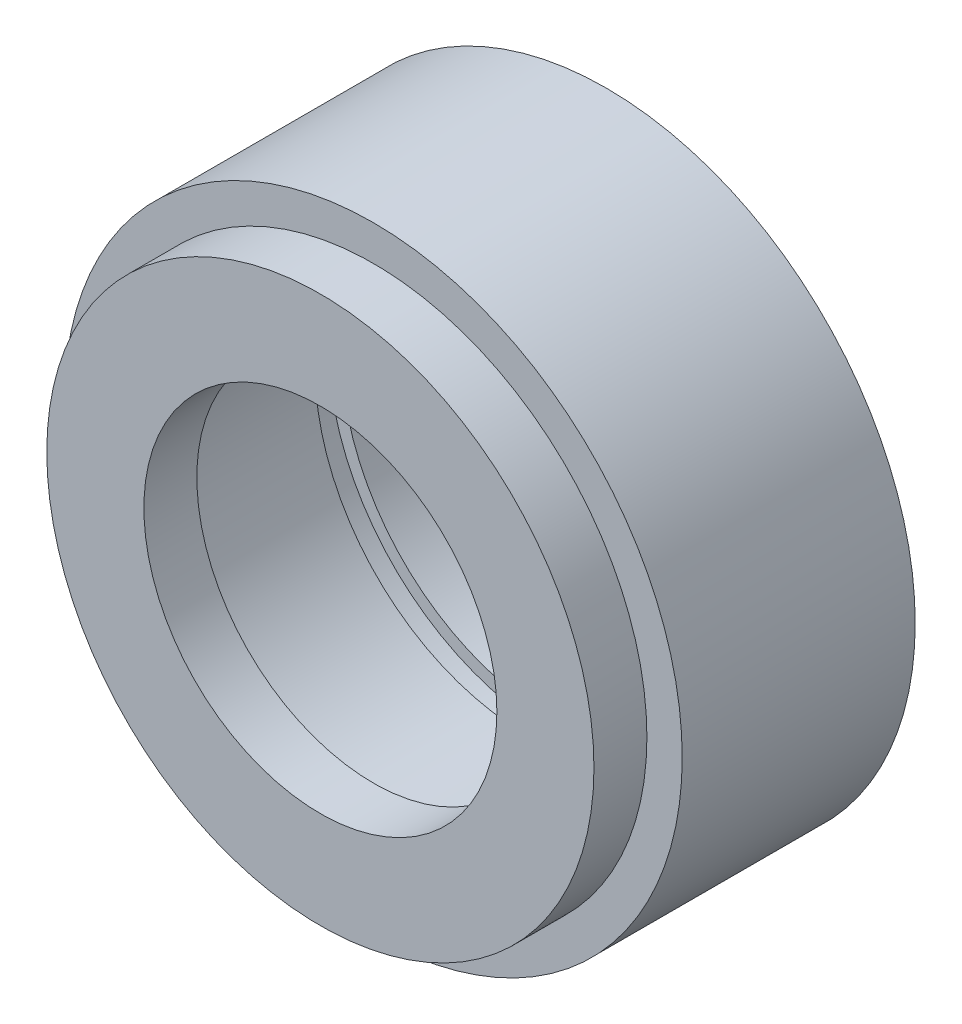
ISO-10303-21;
HEADER;
FILE_DESCRIPTION(('STEP AP214'),'2;1');
FILE_NAME('part.step','',(''),(''),'','','');
FILE_SCHEMA(('AUTOMOTIVE_DESIGN { 1 0 10303 214 1 1 1 1 }'));
ENDSEC;
DATA;
#1=APPLICATION_CONTEXT('core data for automotive mechanical design processes');
#2=APPLICATION_PROTOCOL_DEFINITION('international standard','automotive_design',2000,#1);
#3=PRODUCT_CONTEXT('',#1,'mechanical');
#4=PRODUCT('Part','Part','',(#3));
#5=PRODUCT_RELATED_PRODUCT_CATEGORY('part','',(#4));
#6=PRODUCT_DEFINITION_FORMATION('','',#4);
#7=PRODUCT_DEFINITION_CONTEXT('part definition',#1,'design');
#8=PRODUCT_DEFINITION('design','',#6,#7);
#9=PRODUCT_DEFINITION_SHAPE('','',#8);
#10=(LENGTH_UNIT() NAMED_UNIT(*) SI_UNIT(.MILLI.,.METRE.));
#11=(NAMED_UNIT(*) PLANE_ANGLE_UNIT() SI_UNIT($,.RADIAN.));
#12=(NAMED_UNIT(*) SI_UNIT($,.STERADIAN.) SOLID_ANGLE_UNIT());
#13=UNCERTAINTY_MEASURE_WITH_UNIT(LENGTH_MEASURE(1.E-05),#10,'distance_accuracy_value','');
#14=(GEOMETRIC_REPRESENTATION_CONTEXT(3) GLOBAL_UNCERTAINTY_ASSIGNED_CONTEXT((#13)) GLOBAL_UNIT_ASSIGNED_CONTEXT((#10,
#11,#12)) REPRESENTATION_CONTEXT('',''));
#15=CARTESIAN_POINT('',(0.,0.,0.));
#16=DIRECTION('',(0.,0.,1.));
#17=DIRECTION('',(1.,0.,0.));
#18=AXIS2_PLACEMENT_3D('',#15,#16,#17);
#19=CARTESIAN_POINT('',(0.,0.,999.999999999999));
#20=DIRECTION('',(0.,0.,1.));
#21=DIRECTION('',(1.,0.,0.));
#22=AXIS2_PLACEMENT_3D('',#19,#20,#21);
#23=CYLINDRICAL_SURFACE('',#22,12.);
#24=CARTESIAN_POINT('',(0.,0.,0.299999999999967));
#25=DIRECTION('',(0.,0.,1.));
#26=DIRECTION('',(1.,0.,0.));
#27=AXIS2_PLACEMENT_3D('',#24,#25,#26);
#28=CIRCLE('',#27,12.);
#29=CARTESIAN_POINT('',(12.,0.,0.299999999999968));
#30=VERTEX_POINT('',#29);
#31=EDGE_CURVE('E10',#30,#30,#28,.T.);
#32=ORIENTED_EDGE('',*,*,#31,.F.);
#33=EDGE_LOOP('',(#32));
#34=FACE_BOUND('',#33,.T.);
#35=CARTESIAN_POINT('',(1.11022302462516E-13,-1.11022302462516E-13,9.00000000000001));
#36=DIRECTION('',(0.,0.,1.));
#37=DIRECTION('',(1.,0.,0.));
#38=AXIS2_PLACEMENT_3D('',#35,#36,#37);
#39=CIRCLE('',#38,12.);
#40=CARTESIAN_POINT('',(12.0000000000001,-1.11245271162047E-13,9.00000000000001));
#41=VERTEX_POINT('',#40);
#42=EDGE_CURVE('E70',#41,#41,#39,.T.);
#43=ORIENTED_EDGE('',*,*,#42,.T.);
#44=EDGE_LOOP('',(#43));
#45=FACE_BOUND('',#44,.T.);
#46=ADVANCED_FACE('F30',(#34,#45),#23,.F.);
#47=CARTESIAN_POINT('',(0.,12.75,0.299999999999995));
#48=DIRECTION('',(0.,0.,1.));
#49=DIRECTION('',(1.,0.,0.));
#50=AXIS2_PLACEMENT_3D('',#47,#48,#49);
#51=PLANE('',#50);
#52=CARTESIAN_POINT('',(0.,0.,0.299999999999967));
#53=DIRECTION('',(0.,0.,1.));
#54=DIRECTION('',(1.,0.,0.));
#55=AXIS2_PLACEMENT_3D('',#52,#53,#54);
#56=CIRCLE('',#55,12.75);
#57=CARTESIAN_POINT('',(12.75,0.,0.299999999999968));
#58=VERTEX_POINT('',#57);
#59=EDGE_CURVE('E36',#58,#58,#56,.T.);
#60=ORIENTED_EDGE('',*,*,#59,.F.);
#61=EDGE_LOOP('',(#60));
#62=FACE_BOUND('',#61,.T.);
#63=ORIENTED_EDGE('',*,*,#31,.T.);
#64=EDGE_LOOP('',(#63));
#65=FACE_BOUND('',#64,.T.);
#66=ADVANCED_FACE('F131',(#62,#65),#51,.F.);
#67=CARTESIAN_POINT('',(0.,0.,999.999999999999));
#68=DIRECTION('',(0.,0.,1.));
#69=DIRECTION('',(1.,0.,0.));
#70=AXIS2_PLACEMENT_3D('',#67,#68,#69);
#71=CYLINDRICAL_SURFACE('',#70,12.75);
#72=CARTESIAN_POINT('',(1.11022302462516E-13,0.,-1.20000000000009));
#73=DIRECTION('',(0.,0.,1.));
#74=DIRECTION('',(1.,0.,0.));
#75=AXIS2_PLACEMENT_3D('',#72,#73,#74);
#76=CIRCLE('',#75,12.75);
#77=CARTESIAN_POINT('',(12.7500000000001,0.,-1.20000000000009));
#78=VERTEX_POINT('',#77);
#79=EDGE_CURVE('E40',#78,#78,#76,.T.);
#80=ORIENTED_EDGE('',*,*,#79,.F.);
#81=EDGE_LOOP('',(#80));
#82=FACE_BOUND('',#81,.T.);
#83=ORIENTED_EDGE('',*,*,#59,.T.);
#84=EDGE_LOOP('',(#83));
#85=FACE_BOUND('',#84,.T.);
#86=ADVANCED_FACE('F126',(#82,#85),#71,.F.);
#87=CARTESIAN_POINT('',(1.11022302462516E-13,12.,-1.20000000000001));
#88=DIRECTION('',(0.,0.,-1.));
#89=DIRECTION('',(-1.,0.,0.));
#90=AXIS2_PLACEMENT_3D('',#87,#88,#89);
#91=PLANE('',#90);
#92=CARTESIAN_POINT('',(1.11022302462516E-13,0.,-1.20000000000009));
#93=DIRECTION('',(0.,0.,1.));
#94=DIRECTION('',(1.,0.,0.));
#95=AXIS2_PLACEMENT_3D('',#92,#93,#94);
#96=CIRCLE('',#95,12.);
#97=CARTESIAN_POINT('',(12.0000000000001,0.,-1.20000000000009));
#98=VERTEX_POINT('',#97);
#99=EDGE_CURVE('E44',#98,#98,#96,.T.);
#100=ORIENTED_EDGE('',*,*,#99,.F.);
#101=EDGE_LOOP('',(#100));
#102=FACE_BOUND('',#101,.T.);
#103=ORIENTED_EDGE('',*,*,#79,.T.);
#104=EDGE_LOOP('',(#103));
#105=FACE_BOUND('',#104,.T.);
#106=ADVANCED_FACE('F120',(#102,#105),#91,.F.);
#107=CARTESIAN_POINT('',(0.,0.,999.999999999999));
#108=DIRECTION('',(0.,0.,1.));
#109=DIRECTION('',(1.,0.,0.));
#110=AXIS2_PLACEMENT_3D('',#107,#108,#109);
#111=CYLINDRICAL_SURFACE('',#110,12.);
#112=CARTESIAN_POINT('',(1.11022302462516E-13,0.,-4.19999999999998));
#113=DIRECTION('',(0.,0.,1.));
#114=DIRECTION('',(1.,0.,0.));
#115=AXIS2_PLACEMENT_3D('',#112,#113,#114);
#116=CIRCLE('',#115,12.);
#117=CARTESIAN_POINT('',(12.0000000000001,0.,-4.19999999999998));
#118=VERTEX_POINT('',#117);
#119=EDGE_CURVE('E49',#118,#118,#116,.T.);
#120=ORIENTED_EDGE('',*,*,#119,.F.);
#121=EDGE_LOOP('',(#120));
#122=FACE_BOUND('',#121,.T.);
#123=ORIENTED_EDGE('',*,*,#99,.T.);
#124=EDGE_LOOP('',(#123));
#125=FACE_BOUND('',#124,.T.);
#126=ADVANCED_FACE('F114',(#122,#125),#111,.F.);
#127=CARTESIAN_POINT('',(0.,17.5,-4.2));
#128=DIRECTION('',(0.,0.,1.));
#129=DIRECTION('',(1.,0.,0.));
#130=AXIS2_PLACEMENT_3D('',#127,#128,#129);
#131=PLANE('',#130);
#132=CARTESIAN_POINT('',(1.11022302462516E-13,0.,-4.19999999999998));
#133=DIRECTION('',(0.,0.,1.));
#134=DIRECTION('',(1.,0.,0.));
#135=AXIS2_PLACEMENT_3D('',#132,#133,#134);
#136=CIRCLE('',#135,17.5);
#137=CARTESIAN_POINT('',(17.5000000000001,0.,-4.19999999999998));
#138=VERTEX_POINT('',#137);
#139=EDGE_CURVE('E52',#138,#138,#136,.T.);
#140=ORIENTED_EDGE('',*,*,#139,.F.);
#141=EDGE_LOOP('',(#140));
#142=FACE_BOUND('',#141,.T.);
#143=ORIENTED_EDGE('',*,*,#119,.T.);
#144=EDGE_LOOP('',(#143));
#145=FACE_BOUND('',#144,.T.);
#146=ADVANCED_FACE('F108',(#142,#145),#131,.F.);
#147=CARTESIAN_POINT('',(0.,0.,999.999999999999));
#148=DIRECTION('',(0.,0.,1.));
#149=DIRECTION('',(1.,0.,0.));
#150=AXIS2_PLACEMENT_3D('',#147,#148,#149);
#151=CYLINDRICAL_SURFACE('',#150,17.5);
#152=CARTESIAN_POINT('',(1.11022302462516E-13,-1.11022302462516E-13,9.00000000000001));
#153=DIRECTION('',(0.,0.,1.));
#154=DIRECTION('',(1.,0.,0.));
#155=AXIS2_PLACEMENT_3D('',#152,#153,#154);
#156=CIRCLE('',#155,17.5);
#157=CARTESIAN_POINT('',(17.5000000000001,-1.11347465149333E-13,9.00000000000001));
#158=VERTEX_POINT('',#157);
#159=EDGE_CURVE('E55',#158,#158,#156,.T.);
#160=ORIENTED_EDGE('',*,*,#159,.F.);
#161=EDGE_LOOP('',(#160));
#162=FACE_BOUND('',#161,.T.);
#163=ORIENTED_EDGE('',*,*,#139,.T.);
#164=EDGE_LOOP('',(#163));
#165=FACE_BOUND('',#164,.T.);
#166=ADVANCED_FACE('F102',(#162,#165),#151,.T.);
#167=CARTESIAN_POINT('',(1.11022302462516E-13,15.4999999999999,8.99999999999999));
#168=DIRECTION('',(0.,0.,-1.));
#169=DIRECTION('',(-1.,0.,0.));
#170=AXIS2_PLACEMENT_3D('',#167,#168,#169);
#171=PLANE('',#170);
#172=CARTESIAN_POINT('',(1.11022302462516E-13,-1.11022302462516E-13,9.00000000000001));
#173=DIRECTION('',(0.,0.,1.));
#174=DIRECTION('',(1.,0.,0.));
#175=AXIS2_PLACEMENT_3D('',#172,#173,#174);
#176=CIRCLE('',#175,15.5);
#177=CARTESIAN_POINT('',(15.5000000000001,-1.11310303699411E-13,9.00000000000001));
#178=VERTEX_POINT('',#177);
#179=EDGE_CURVE('E58',#178,#178,#176,.T.);
#180=ORIENTED_EDGE('',*,*,#179,.F.);
#181=EDGE_LOOP('',(#180));
#182=FACE_BOUND('',#181,.T.);
#183=ORIENTED_EDGE('',*,*,#159,.T.);
#184=EDGE_LOOP('',(#183));
#185=FACE_BOUND('',#184,.T.);
#186=ADVANCED_FACE('F96',(#182,#185),#171,.F.);
#187=CARTESIAN_POINT('',(0.,0.,999.999999999999));
#188=DIRECTION('',(0.,0.,1.));
#189=DIRECTION('',(1.,0.,0.));
#190=AXIS2_PLACEMENT_3D('',#187,#188,#189);
#191=CYLINDRICAL_SURFACE('',#190,15.5);
#192=CARTESIAN_POINT('',(-1.66533453693773E-13,-1.11022302462516E-13,12.));
#193=DIRECTION('',(0.,0.,1.));
#194=DIRECTION('',(1.,0.,0.));
#195=AXIS2_PLACEMENT_3D('',#192,#193,#194);
#196=CIRCLE('',#195,15.5);
#197=CARTESIAN_POINT('',(15.4999999999998,-1.11310303699411E-13,12.));
#198=VERTEX_POINT('',#197);
#199=EDGE_CURVE('E61',#198,#198,#196,.T.);
#200=ORIENTED_EDGE('',*,*,#199,.F.);
#201=EDGE_LOOP('',(#200));
#202=FACE_BOUND('',#201,.T.);
#203=ORIENTED_EDGE('',*,*,#179,.T.);
#204=EDGE_LOOP('',(#203));
#205=FACE_BOUND('',#204,.T.);
#206=ADVANCED_FACE('F90',(#202,#205),#191,.T.);
#207=CARTESIAN_POINT('',(-1.66533453693773E-13,9.9999999999999,12.));
#208=DIRECTION('',(0.,0.,-1.));
#209=DIRECTION('',(-1.,0.,0.));
#210=AXIS2_PLACEMENT_3D('',#207,#208,#209);
#211=PLANE('',#210);
#212=CARTESIAN_POINT('',(-1.66533453693773E-13,-1.11022302462516E-13,12.));
#213=DIRECTION('',(0.,0.,1.));
#214=DIRECTION('',(1.,0.,0.));
#215=AXIS2_PLACEMENT_3D('',#212,#213,#214);
#216=CIRCLE('',#215,10.);
#217=CARTESIAN_POINT('',(9.99999999999984,-1.11208109712125E-13,12.));
#218=VERTEX_POINT('',#217);
#219=EDGE_CURVE('E64',#218,#218,#216,.T.);
#220=ORIENTED_EDGE('',*,*,#219,.F.);
#221=EDGE_LOOP('',(#220));
#222=FACE_BOUND('',#221,.T.);
#223=ORIENTED_EDGE('',*,*,#199,.T.);
#224=EDGE_LOOP('',(#223));
#225=FACE_BOUND('',#224,.T.);
#226=ADVANCED_FACE('F84',(#222,#225),#211,.F.);
#227=CARTESIAN_POINT('',(0.,0.,999.999999999999));
#228=DIRECTION('',(0.,0.,1.));
#229=DIRECTION('',(1.,0.,0.));
#230=AXIS2_PLACEMENT_3D('',#227,#228,#229);
#231=CYLINDRICAL_SURFACE('',#230,10.);
#232=CARTESIAN_POINT('',(1.11022302462516E-13,-1.11022302462516E-13,9.00000000000001));
#233=DIRECTION('',(0.,0.,1.));
#234=DIRECTION('',(1.,0.,0.));
#235=AXIS2_PLACEMENT_3D('',#232,#233,#234);
#236=CIRCLE('',#235,10.);
#237=CARTESIAN_POINT('',(10.0000000000001,-1.11208109712125E-13,9.00000000000001));
#238=VERTEX_POINT('',#237);
#239=EDGE_CURVE('E67',#238,#238,#236,.T.);
#240=ORIENTED_EDGE('',*,*,#239,.F.);
#241=EDGE_LOOP('',(#240));
#242=FACE_BOUND('',#241,.T.);
#243=ORIENTED_EDGE('',*,*,#219,.T.);
#244=EDGE_LOOP('',(#243));
#245=FACE_BOUND('',#244,.T.);
#246=ADVANCED_FACE('F78',(#242,#245),#231,.F.);
#247=CARTESIAN_POINT('',(1.11022302462516E-13,11.9999999999999,8.99999999999999));
#248=DIRECTION('',(0.,0.,1.));
#249=DIRECTION('',(1.,0.,0.));
#250=AXIS2_PLACEMENT_3D('',#247,#248,#249);
#251=PLANE('',#250);
#252=ORIENTED_EDGE('',*,*,#42,.F.);
#253=EDGE_LOOP('',(#252));
#254=FACE_BOUND('',#253,.T.);
#255=ORIENTED_EDGE('',*,*,#239,.T.);
#256=EDGE_LOOP('',(#255));
#257=FACE_BOUND('',#256,.T.);
#258=ADVANCED_FACE('F75',(#254,#257),#251,.F.);
#259=CLOSED_SHELL('',(#46,#66,#86,#106,#126,#146,#166,#186,#206,#226,#246,#258));
#260=MANIFOLD_SOLID_BREP('B2',#259);
#261=ADVANCED_BREP_SHAPE_REPRESENTATION('',(#18,#260),#14);
#262=SHAPE_DEFINITION_REPRESENTATION(#9,#261);
ENDSEC;
END-ISO-10303-21;
